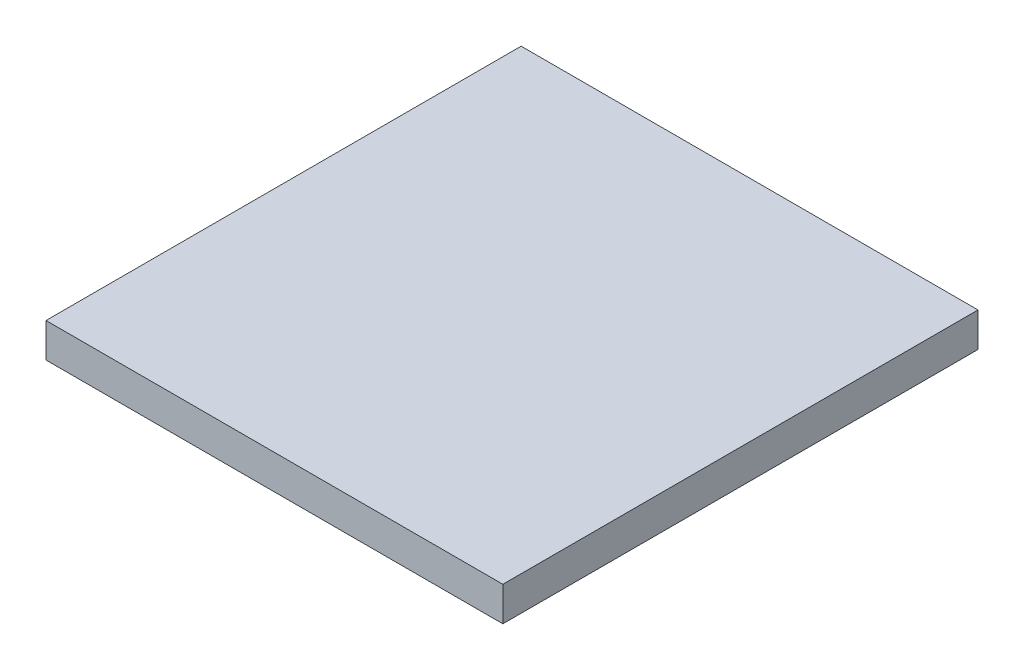
ISO-10303-21;
HEADER;
FILE_DESCRIPTION(('STEP AP214'),'2;1');
FILE_NAME('part.step','',(''),(''),'','','');
FILE_SCHEMA(('AUTOMOTIVE_DESIGN { 1 0 10303 214 1 1 1 1 }'));
ENDSEC;
DATA;
#1=APPLICATION_CONTEXT('core data for automotive mechanical design processes');
#2=APPLICATION_PROTOCOL_DEFINITION('international standard','automotive_design',2000,#1);
#3=PRODUCT_CONTEXT('',#1,'mechanical');
#4=PRODUCT('Part','Part','',(#3));
#5=PRODUCT_RELATED_PRODUCT_CATEGORY('part','',(#4));
#6=PRODUCT_DEFINITION_FORMATION('','',#4);
#7=PRODUCT_DEFINITION_CONTEXT('part definition',#1,'design');
#8=PRODUCT_DEFINITION('design','',#6,#7);
#9=PRODUCT_DEFINITION_SHAPE('','',#8);
#10=(LENGTH_UNIT() NAMED_UNIT(*) SI_UNIT(.MILLI.,.METRE.));
#11=(NAMED_UNIT(*) PLANE_ANGLE_UNIT() SI_UNIT($,.RADIAN.));
#12=(NAMED_UNIT(*) SI_UNIT($,.STERADIAN.) SOLID_ANGLE_UNIT());
#13=UNCERTAINTY_MEASURE_WITH_UNIT(LENGTH_MEASURE(1.E-05),#10,'distance_accuracy_value','');
#14=(GEOMETRIC_REPRESENTATION_CONTEXT(3) GLOBAL_UNCERTAINTY_ASSIGNED_CONTEXT((#13)) GLOBAL_UNIT_ASSIGNED_CONTEXT((#10,
#11,#12)) REPRESENTATION_CONTEXT('',''));
#15=CARTESIAN_POINT('',(0.,0.,0.));
#16=DIRECTION('',(0.,0.,1.));
#17=DIRECTION('',(1.,0.,0.));
#18=AXIS2_PLACEMENT_3D('',#15,#16,#17);
#19=CARTESIAN_POINT('',(56.7895557875379,-700.04644552721,-33.6059322665191));
#20=DIRECTION('',(1.,0.,0.));
#21=DIRECTION('',(0.,0.,-1.));
#22=AXIS2_PLACEMENT_3D('',#19,#20,#21);
#23=PLANE('',#22);
#24=DIRECTION('',(0.,-1.,0.));
#25=VECTOR('',#24,1.);
#26=CARTESIAN_POINT('',(56.7895557875379,-700.04644552721,-86.4379322665192));
#27=LINE('',#26,#25);
#28=CARTESIAN_POINT('',(56.7895557875379,-700.04644552721,-86.4379322665192));
#29=VERTEX_POINT('',#28);
#30=CARTESIAN_POINT('',(56.7895557875379,-703.85644552721,-86.4379322665192));
#31=VERTEX_POINT('',#30);
#32=EDGE_CURVE('E100',#29,#31,#27,.T.);
#33=ORIENTED_EDGE('',*,*,#32,.T.);
#34=DIRECTION('',(0.,0.,-1.));
#35=VECTOR('',#34,1.);
#36=CARTESIAN_POINT('',(56.7895557875379,-703.85644552721,-33.6059322665191));
#37=LINE('',#36,#35);
#38=CARTESIAN_POINT('',(56.7895557875379,-703.85644552721,-33.6059322665191));
#39=VERTEX_POINT('',#38);
#40=EDGE_CURVE('E11',#39,#31,#37,.T.);
#41=ORIENTED_EDGE('',*,*,#40,.F.);
#42=DIRECTION('',(0.,-1.,0.));
#43=VECTOR('',#42,1.);
#44=CARTESIAN_POINT('',(56.7895557875379,-700.04644552721,-33.6059322665191));
#45=LINE('',#44,#43);
#46=CARTESIAN_POINT('',(56.7895557875379,-700.04644552721,-33.6059322665191));
#47=VERTEX_POINT('',#46);
#48=EDGE_CURVE('E88',#47,#39,#45,.T.);
#49=ORIENTED_EDGE('',*,*,#48,.F.);
#50=DIRECTION('',(0.,0.,-1.));
#51=VECTOR('',#50,1.);
#52=CARTESIAN_POINT('',(56.7895557875379,-700.04644552721,-33.6059322665191));
#53=LINE('',#52,#51);
#54=EDGE_CURVE('E96',#47,#29,#53,.T.);
#55=ORIENTED_EDGE('',*,*,#54,.T.);
#56=EDGE_LOOP('',(#33,#41,#49,#55));
#57=FACE_BOUND('',#56,.T.);
#58=ADVANCED_FACE('F37',(#57),#23,.F.);
#59=CARTESIAN_POINT('',(56.7895557875379,-703.85644552721,-33.6059322665191));
#60=DIRECTION('',(0.,1.,0.));
#61=DIRECTION('',(0.,0.,1.));
#62=AXIS2_PLACEMENT_3D('',#59,#60,#61);
#63=PLANE('',#62);
#64=DIRECTION('',(1.,0.,0.));
#65=VECTOR('',#64,1.);
#66=CARTESIAN_POINT('',(56.7895557875379,-703.85644552721,-86.4379322665192));
#67=LINE('',#66,#65);
#68=CARTESIAN_POINT('',(107.589555787538,-703.85644552721,-86.4379322665192));
#69=VERTEX_POINT('',#68);
#70=EDGE_CURVE('E92',#31,#69,#67,.T.);
#71=ORIENTED_EDGE('',*,*,#70,.T.);
#72=DIRECTION('',(0.,0.,-1.));
#73=VECTOR('',#72,1.);
#74=CARTESIAN_POINT('',(107.589555787538,-703.85644552721,-33.6059322665191));
#75=LINE('',#74,#73);
#76=CARTESIAN_POINT('',(107.589555787538,-703.85644552721,-33.6059322665191));
#77=VERTEX_POINT('',#76);
#78=EDGE_CURVE('E45',#77,#69,#75,.T.);
#79=ORIENTED_EDGE('',*,*,#78,.F.);
#80=DIRECTION('',(1.,0.,0.));
#81=VECTOR('',#80,1.);
#82=CARTESIAN_POINT('',(56.7895557875379,-703.85644552721,-33.6059322665191));
#83=LINE('',#82,#81);
#84=EDGE_CURVE('E83',#39,#77,#83,.T.);
#85=ORIENTED_EDGE('',*,*,#84,.F.);
#86=ORIENTED_EDGE('',*,*,#40,.T.);
#87=EDGE_LOOP('',(#71,#79,#85,#86));
#88=FACE_BOUND('',#87,.T.);
#89=ADVANCED_FACE('F91',(#88),#63,.F.);
#90=CARTESIAN_POINT('',(107.589555787538,-700.04644552721,-33.6059322665191));
#91=DIRECTION('',(-1.,0.,0.));
#92=DIRECTION('',(0.,0.,1.));
#93=AXIS2_PLACEMENT_3D('',#90,#91,#92);
#94=PLANE('',#93);
#95=DIRECTION('',(0.,1.,0.));
#96=VECTOR('',#95,1.);
#97=CARTESIAN_POINT('',(107.589555787538,-700.04644552721,-86.4379322665192));
#98=LINE('',#97,#96);
#99=CARTESIAN_POINT('',(107.589555787538,-700.04644552721,-86.4379322665192));
#100=VERTEX_POINT('',#99);
#101=EDGE_CURVE('E70',#69,#100,#98,.T.);
#102=ORIENTED_EDGE('',*,*,#101,.T.);
#103=DIRECTION('',(0.,0.,-1.));
#104=VECTOR('',#103,1.);
#105=CARTESIAN_POINT('',(107.589555787538,-700.04644552721,-33.6059322665191));
#106=LINE('',#105,#104);
#107=CARTESIAN_POINT('',(107.589555787538,-700.04644552721,-33.6059322665191));
#108=VERTEX_POINT('',#107);
#109=EDGE_CURVE('E93',#108,#100,#106,.T.);
#110=ORIENTED_EDGE('',*,*,#109,.F.);
#111=DIRECTION('',(0.,1.,0.));
#112=VECTOR('',#111,1.);
#113=CARTESIAN_POINT('',(107.589555787538,-700.04644552721,-33.6059322665191));
#114=LINE('',#113,#112);
#115=EDGE_CURVE('E86',#77,#108,#114,.T.);
#116=ORIENTED_EDGE('',*,*,#115,.F.);
#117=ORIENTED_EDGE('',*,*,#78,.T.);
#118=EDGE_LOOP('',(#102,#110,#116,#117));
#119=FACE_BOUND('',#118,.T.);
#120=ADVANCED_FACE('F94',(#119),#94,.F.);
#121=CARTESIAN_POINT('',(56.7895557875379,-700.04644552721,-33.6059322665191));
#122=DIRECTION('',(0.,-1.,0.));
#123=DIRECTION('',(0.,0.,-1.));
#124=AXIS2_PLACEMENT_3D('',#121,#122,#123);
#125=PLANE('',#124);
#126=DIRECTION('',(-1.,0.,0.));
#127=VECTOR('',#126,1.);
#128=CARTESIAN_POINT('',(56.7895557875379,-700.04644552721,-86.4379322665192));
#129=LINE('',#128,#127);
#130=EDGE_CURVE('E76',#100,#29,#129,.T.);
#131=ORIENTED_EDGE('',*,*,#130,.T.);
#132=ORIENTED_EDGE('',*,*,#54,.F.);
#133=DIRECTION('',(-1.,0.,0.));
#134=VECTOR('',#133,1.);
#135=CARTESIAN_POINT('',(56.7895557875379,-700.04644552721,-33.6059322665191));
#136=LINE('',#135,#134);
#137=EDGE_CURVE('E53',#108,#47,#136,.T.);
#138=ORIENTED_EDGE('',*,*,#137,.F.);
#139=ORIENTED_EDGE('',*,*,#109,.T.);
#140=EDGE_LOOP('',(#131,#132,#138,#139));
#141=FACE_BOUND('',#140,.T.);
#142=ADVANCED_FACE('F107',(#141),#125,.F.);
#143=CARTESIAN_POINT('',(0.,0.,-33.6059322665191));
#144=DIRECTION('',(0.,0.,1.));
#145=DIRECTION('',(1.,0.,0.));
#146=AXIS2_PLACEMENT_3D('',#143,#144,#145);
#147=PLANE('',#146);
#148=ORIENTED_EDGE('',*,*,#48,.T.);
#149=ORIENTED_EDGE('',*,*,#84,.T.);
#150=ORIENTED_EDGE('',*,*,#115,.T.);
#151=ORIENTED_EDGE('',*,*,#137,.T.);
#152=EDGE_LOOP('',(#148,#149,#150,#151));
#153=FACE_BOUND('',#152,.T.);
#154=ADVANCED_FACE('F84',(#153),#147,.T.);
#155=CARTESIAN_POINT('',(0.,0.,-86.4379322665192));
#156=DIRECTION('',(0.,0.,1.));
#157=DIRECTION('',(1.,0.,0.));
#158=AXIS2_PLACEMENT_3D('',#155,#156,#157);
#159=PLANE('',#158);
#160=ORIENTED_EDGE('',*,*,#32,.F.);
#161=ORIENTED_EDGE('',*,*,#130,.F.);
#162=ORIENTED_EDGE('',*,*,#101,.F.);
#163=ORIENTED_EDGE('',*,*,#70,.F.);
#164=EDGE_LOOP('',(#160,#161,#162,#163));
#165=FACE_BOUND('',#164,.T.);
#166=ADVANCED_FACE('F110',(#165),#159,.F.);
#167=CLOSED_SHELL('',(#58,#89,#120,#142,#154,#166));
#168=MANIFOLD_SOLID_BREP('B2',#167);
#169=ADVANCED_BREP_SHAPE_REPRESENTATION('',(#18,#168),#14);
#170=SHAPE_DEFINITION_REPRESENTATION(#9,#169);
ENDSEC;
END-ISO-10303-21;
